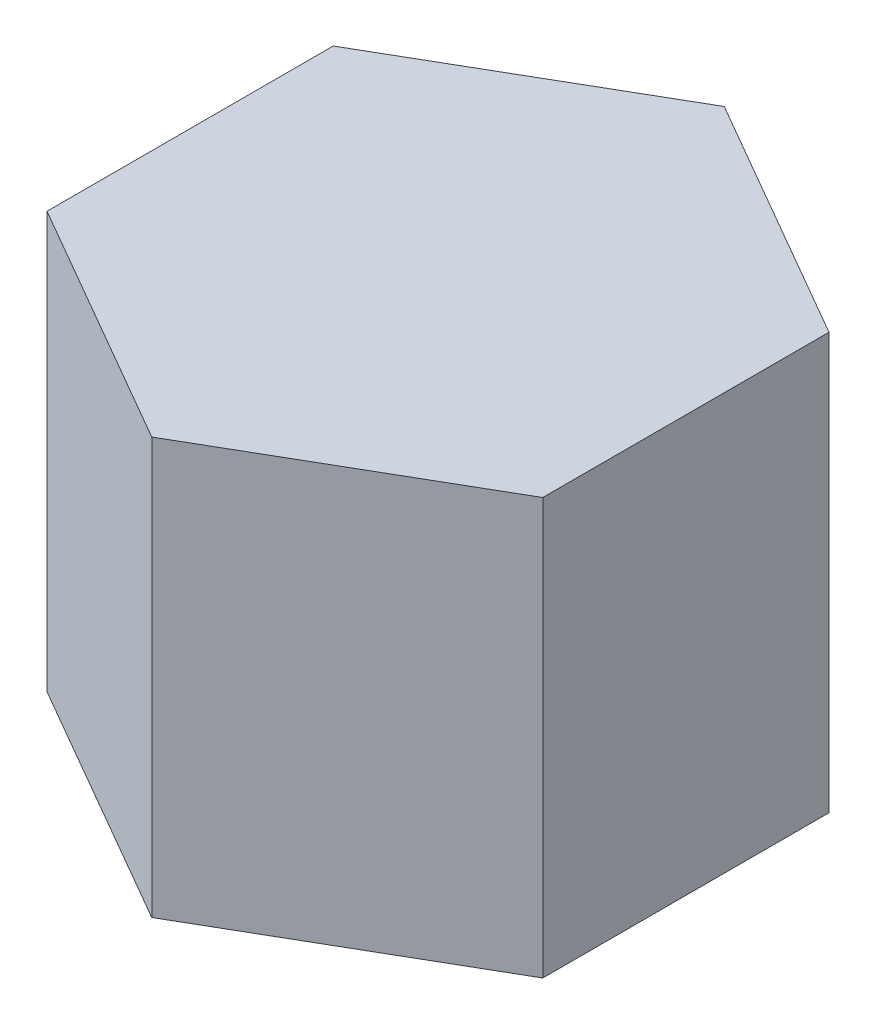
ISO-10303-21;
HEADER;
FILE_DESCRIPTION(('STEP AP214'),'2;1');
FILE_NAME('part.step','',(''),(''),'','','');
FILE_SCHEMA(('AUTOMOTIVE_DESIGN { 1 0 10303 214 1 1 1 1 }'));
ENDSEC;
DATA;
#1=APPLICATION_CONTEXT('core data for automotive mechanical design processes');
#2=APPLICATION_PROTOCOL_DEFINITION('international standard','automotive_design',2000,#1);
#3=PRODUCT_CONTEXT('',#1,'mechanical');
#4=PRODUCT('Part','Part','',(#3));
#5=PRODUCT_RELATED_PRODUCT_CATEGORY('part','',(#4));
#6=PRODUCT_DEFINITION_FORMATION('','',#4);
#7=PRODUCT_DEFINITION_CONTEXT('part definition',#1,'design');
#8=PRODUCT_DEFINITION('design','',#6,#7);
#9=PRODUCT_DEFINITION_SHAPE('','',#8);
#10=(LENGTH_UNIT() NAMED_UNIT(*) SI_UNIT(.MILLI.,.METRE.));
#11=(NAMED_UNIT(*) PLANE_ANGLE_UNIT() SI_UNIT($,.RADIAN.));
#12=(NAMED_UNIT(*) SI_UNIT($,.STERADIAN.) SOLID_ANGLE_UNIT());
#13=UNCERTAINTY_MEASURE_WITH_UNIT(LENGTH_MEASURE(1.E-05),#10,'distance_accuracy_value','');
#14=(GEOMETRIC_REPRESENTATION_CONTEXT(3) GLOBAL_UNCERTAINTY_ASSIGNED_CONTEXT((#13)) GLOBAL_UNIT_ASSIGNED_CONTEXT((#10,
#11,#12)) REPRESENTATION_CONTEXT('',''));
#15=CARTESIAN_POINT('',(0.,0.,0.));
#16=DIRECTION('',(0.,0.,1.));
#17=DIRECTION('',(1.,0.,0.));
#18=AXIS2_PLACEMENT_3D('',#15,#16,#17);
#19=CARTESIAN_POINT('',(207.839551417382,-147.556598747966,290.81594581671));
#20=DIRECTION('',(-0.500000000000028,0.,-0.866025403784422));
#21=DIRECTION('',(-0.866025403784423,0.,0.500000000000028));
#22=AXIS2_PLACEMENT_3D('',#19,#20,#21);
#23=PLANE('',#22);
#24=CARTESIAN_POINT('',(208.142660308706,-147.047793579175,290.64094581671));
#25=DIRECTION('',(-0.866025403784422,0.,0.500000000000028));
#26=VECTOR('',#25,1.);
#27=LINE('',#24,#26);
#28=CARTESIAN_POINT('',(208.142660308706,-147.047793579175,290.64094581671));
#29=VERTEX_POINT('',#28);
#30=CARTESIAN_POINT('',(207.839551417382,-147.047793579175,290.81594581671));
#31=VERTEX_POINT('',#30);
#32=EDGE_CURVE('E170',#29,#31,#27,.T.);
#33=ORIENTED_EDGE('',*,*,#32,.T.);
#34=CARTESIAN_POINT('',(207.839551417382,-147.556598747966,290.81594581671));
#35=DIRECTION('',(0.,1.,0.));
#36=VECTOR('',#35,1.);
#37=LINE('',#34,#36);
#38=CARTESIAN_POINT('',(207.839551417382,-147.556598747966,290.81594581671));
#39=VERTEX_POINT('',#38);
#40=EDGE_CURVE('E35',#39,#31,#37,.T.);
#41=ORIENTED_EDGE('',*,*,#40,.F.);
#42=CARTESIAN_POINT('',(208.142660308706,-147.556598747966,290.64094581671));
#43=DIRECTION('',(-0.866025403784422,0.,0.500000000000028));
#44=VECTOR('',#43,1.);
#45=LINE('',#42,#44);
#46=CARTESIAN_POINT('',(208.142660308706,-147.556598747966,290.64094581671));
#47=VERTEX_POINT('',#46);
#48=EDGE_CURVE('E159',#47,#39,#45,.T.);
#49=ORIENTED_EDGE('',*,*,#48,.F.);
#50=CARTESIAN_POINT('',(208.142660308706,-147.556598747966,290.64094581671));
#51=DIRECTION('',(0.,1.,0.));
#52=VECTOR('',#51,1.);
#53=LINE('',#50,#52);
#54=EDGE_CURVE('E10',#47,#29,#53,.T.);
#55=ORIENTED_EDGE('',*,*,#54,.T.);
#56=EDGE_LOOP('',(#33,#41,#49,#55));
#57=FACE_BOUND('',#56,.T.);
#58=ADVANCED_FACE('F16',(#57),#23,.F.);
#59=CARTESIAN_POINT('',(208.142660308706,-147.556598747966,291.594471220494));
#60=DIRECTION('',(-1.,0.,0.));
#61=DIRECTION('',(0.,-1.,0.));
#62=AXIS2_PLACEMENT_3D('',#59,#60,#61);
#63=PLANE('',#62);
#64=CARTESIAN_POINT('',(208.142660308706,-147.047793579175,290.29094581671));
#65=DIRECTION('',(0.,0.,1.));
#66=VECTOR('',#65,1.);
#67=LINE('',#64,#66);
#68=CARTESIAN_POINT('',(208.142660308706,-147.047793579175,290.29094581671));
#69=VERTEX_POINT('',#68);
#70=EDGE_CURVE('E167',#69,#29,#67,.T.);
#71=ORIENTED_EDGE('',*,*,#70,.T.);
#72=ORIENTED_EDGE('',*,*,#54,.F.);
#73=CARTESIAN_POINT('',(208.142660308706,-147.556598747966,290.29094581671));
#74=DIRECTION('',(0.,0.,1.));
#75=VECTOR('',#74,1.);
#76=LINE('',#73,#75);
#77=CARTESIAN_POINT('',(208.142660308706,-147.556598747966,290.29094581671));
#78=VERTEX_POINT('',#77);
#79=EDGE_CURVE('E156',#78,#47,#76,.T.);
#80=ORIENTED_EDGE('',*,*,#79,.F.);
#81=CARTESIAN_POINT('',(208.142660308706,-147.556598747966,290.29094581671));
#82=DIRECTION('',(0.,1.,0.));
#83=VECTOR('',#82,1.);
#84=LINE('',#81,#83);
#85=EDGE_CURVE('E27',#78,#69,#84,.T.);
#86=ORIENTED_EDGE('',*,*,#85,.T.);
#87=EDGE_LOOP('',(#71,#72,#80,#86));
#88=FACE_BOUND('',#87,.T.);
#89=ADVANCED_FACE('F189',(#88),#63,.F.);
#90=CARTESIAN_POINT('',(208.142660308706,-147.556598747966,290.29094581671));
#91=DIRECTION('',(-0.500000000000028,0.,0.866025403784422));
#92=DIRECTION('',(0.866025403784423,0.,0.500000000000028));
#93=AXIS2_PLACEMENT_3D('',#90,#91,#92);
#94=PLANE('',#93);
#95=CARTESIAN_POINT('',(207.839551417381,-147.047793579175,290.11594581671));
#96=DIRECTION('',(0.866025403784422,0.,0.500000000000028));
#97=VECTOR('',#96,1.);
#98=LINE('',#95,#97);
#99=CARTESIAN_POINT('',(207.839551417382,-147.047793579175,290.11594581671));
#100=VERTEX_POINT('',#99);
#101=EDGE_CURVE('E163',#100,#69,#98,.T.);
#102=ORIENTED_EDGE('',*,*,#101,.T.);
#103=ORIENTED_EDGE('',*,*,#85,.F.);
#104=CARTESIAN_POINT('',(207.839551417381,-147.556598747966,290.11594581671));
#105=DIRECTION('',(0.866025403784422,0.,0.500000000000028));
#106=VECTOR('',#105,1.);
#107=LINE('',#104,#106);
#108=CARTESIAN_POINT('',(207.839551417382,-147.556598747966,290.11594581671));
#109=VERTEX_POINT('',#108);
#110=EDGE_CURVE('E106',#109,#78,#107,.T.);
#111=ORIENTED_EDGE('',*,*,#110,.F.);
#112=CARTESIAN_POINT('',(207.839551417382,-147.556598747966,290.11594581671));
#113=DIRECTION('',(0.,1.,0.));
#114=VECTOR('',#113,1.);
#115=LINE('',#112,#114);
#116=EDGE_CURVE('E94',#109,#100,#115,.T.);
#117=ORIENTED_EDGE('',*,*,#116,.T.);
#118=EDGE_LOOP('',(#102,#103,#111,#117));
#119=FACE_BOUND('',#118,.T.);
#120=ADVANCED_FACE('F198',(#119),#94,.F.);
#121=CARTESIAN_POINT('',(207.839551417382,-147.556598747966,290.11594581671));
#122=DIRECTION('',(0.499999999999943,0.,0.866025403784471));
#123=DIRECTION('',(0.866025403784471,0.,-0.499999999999943));
#124=AXIS2_PLACEMENT_3D('',#121,#122,#123);
#125=PLANE('',#124);
#126=CARTESIAN_POINT('',(207.536442526057,-147.047793579175,290.29094581671));
#127=DIRECTION('',(0.866025403784471,0.,-0.499999999999943));
#128=VECTOR('',#127,1.);
#129=LINE('',#126,#128);
#130=CARTESIAN_POINT('',(207.536442526057,-147.047793579175,290.29094581671));
#131=VERTEX_POINT('',#130);
#132=EDGE_CURVE('E162',#131,#100,#129,.T.);
#133=ORIENTED_EDGE('',*,*,#132,.T.);
#134=ORIENTED_EDGE('',*,*,#116,.F.);
#135=CARTESIAN_POINT('',(207.536442526057,-147.556598747966,290.29094581671));
#136=DIRECTION('',(0.866025403784471,0.,-0.499999999999943));
#137=VECTOR('',#136,1.);
#138=LINE('',#135,#137);
#139=CARTESIAN_POINT('',(207.536442526057,-147.556598747966,290.29094581671));
#140=VERTEX_POINT('',#139);
#141=EDGE_CURVE('E98',#140,#109,#138,.T.);
#142=ORIENTED_EDGE('',*,*,#141,.F.);
#143=CARTESIAN_POINT('',(207.536442526057,-147.556598747966,290.29094581671));
#144=DIRECTION('',(0.,1.,0.));
#145=VECTOR('',#144,1.);
#146=LINE('',#143,#145);
#147=EDGE_CURVE('E79',#140,#131,#146,.T.);
#148=ORIENTED_EDGE('',*,*,#147,.T.);
#149=EDGE_LOOP('',(#133,#134,#142,#148));
#150=FACE_BOUND('',#149,.T.);
#151=ADVANCED_FACE('F100',(#150),#125,.F.);
#152=CARTESIAN_POINT('',(207.536442526057,-147.556598747966,291.594471220494));
#153=DIRECTION('',(1.,0.,0.));
#154=DIRECTION('',(0.,1.,0.));
#155=AXIS2_PLACEMENT_3D('',#152,#153,#154);
#156=PLANE('',#155);
#157=CARTESIAN_POINT('',(207.536442526057,-147.047793579175,290.64094581671));
#158=DIRECTION('',(0.,0.,-1.));
#159=VECTOR('',#158,1.);
#160=LINE('',#157,#159);
#161=CARTESIAN_POINT('',(207.536442526057,-147.047793579175,290.64094581671));
#162=VERTEX_POINT('',#161);
#163=EDGE_CURVE('E88',#162,#131,#160,.T.);
#164=ORIENTED_EDGE('',*,*,#163,.T.);
#165=ORIENTED_EDGE('',*,*,#147,.F.);
#166=CARTESIAN_POINT('',(207.536442526057,-147.556598747966,290.64094581671));
#167=DIRECTION('',(0.,0.,-1.));
#168=VECTOR('',#167,1.);
#169=LINE('',#166,#168);
#170=CARTESIAN_POINT('',(207.536442526057,-147.556598747966,290.64094581671));
#171=VERTEX_POINT('',#170);
#172=EDGE_CURVE('E84',#171,#140,#169,.T.);
#173=ORIENTED_EDGE('',*,*,#172,.F.);
#174=CARTESIAN_POINT('',(207.536442526057,-147.556598747966,290.64094581671));
#175=DIRECTION('',(0.,1.,0.));
#176=VECTOR('',#175,1.);
#177=LINE('',#174,#176);
#178=EDGE_CURVE('E58',#171,#162,#177,.T.);
#179=ORIENTED_EDGE('',*,*,#178,.T.);
#180=EDGE_LOOP('',(#164,#165,#173,#179));
#181=FACE_BOUND('',#180,.T.);
#182=ADVANCED_FACE('F82',(#181),#156,.F.);
#183=CARTESIAN_POINT('',(207.536442526057,-147.556598747966,290.64094581671));
#184=DIRECTION('',(0.499999999999978,0.,-0.866025403784452));
#185=DIRECTION('',(-0.866025403784452,0.,-0.499999999999978));
#186=AXIS2_PLACEMENT_3D('',#183,#184,#185);
#187=PLANE('',#186);
#188=CARTESIAN_POINT('',(207.839551417382,-147.047793579175,290.81594581671));
#189=DIRECTION('',(-0.866025403784452,0.,-0.499999999999978));
#190=VECTOR('',#189,1.);
#191=LINE('',#188,#190);
#192=EDGE_CURVE('E160',#31,#162,#191,.T.);
#193=ORIENTED_EDGE('',*,*,#192,.T.);
#194=ORIENTED_EDGE('',*,*,#178,.F.);
#195=CARTESIAN_POINT('',(207.839551417382,-147.556598747966,290.81594581671));
#196=DIRECTION('',(-0.866025403784452,0.,-0.499999999999978));
#197=VECTOR('',#196,1.);
#198=LINE('',#195,#197);
#199=EDGE_CURVE('E112',#39,#171,#198,.T.);
#200=ORIENTED_EDGE('',*,*,#199,.F.);
#201=ORIENTED_EDGE('',*,*,#40,.T.);
#202=EDGE_LOOP('',(#193,#194,#200,#201));
#203=FACE_BOUND('',#202,.T.);
#204=ADVANCED_FACE('F131',(#203),#187,.F.);
#205=CARTESIAN_POINT('',(206.491105863044,-147.556598747966,291.594471220494));
#206=DIRECTION('',(0.,1.,0.));
#207=DIRECTION('',(-1.,0.,0.));
#208=AXIS2_PLACEMENT_3D('',#205,#206,#207);
#209=PLANE('',#208);
#210=ORIENTED_EDGE('',*,*,#48,.T.);
#211=ORIENTED_EDGE('',*,*,#199,.T.);
#212=ORIENTED_EDGE('',*,*,#172,.T.);
#213=ORIENTED_EDGE('',*,*,#141,.T.);
#214=ORIENTED_EDGE('',*,*,#110,.T.);
#215=ORIENTED_EDGE('',*,*,#79,.T.);
#216=EDGE_LOOP('',(#210,#211,#212,#213,#214,#215));
#217=FACE_BOUND('',#216,.T.);
#218=ADVANCED_FACE('F111',(#217),#209,.F.);
#219=CARTESIAN_POINT('',(206.491105863044,-147.047793579175,291.594471220494));
#220=DIRECTION('',(0.,1.,0.));
#221=DIRECTION('',(-1.,0.,0.));
#222=AXIS2_PLACEMENT_3D('',#219,#220,#221);
#223=PLANE('',#222);
#224=ORIENTED_EDGE('',*,*,#32,.F.);
#225=ORIENTED_EDGE('',*,*,#70,.F.);
#226=ORIENTED_EDGE('',*,*,#101,.F.);
#227=ORIENTED_EDGE('',*,*,#132,.F.);
#228=ORIENTED_EDGE('',*,*,#163,.F.);
#229=ORIENTED_EDGE('',*,*,#192,.F.);
#230=EDGE_LOOP('',(#224,#225,#226,#227,#228,#229));
#231=FACE_BOUND('',#230,.T.);
#232=ADVANCED_FACE('F130',(#231),#223,.T.);
#233=CLOSED_SHELL('',(#58,#89,#120,#151,#182,#204,#218,#232));
#234=MANIFOLD_SOLID_BREP('B1',#233);
#235=ADVANCED_BREP_SHAPE_REPRESENTATION('',(#18,#234),#14);
#236=SHAPE_DEFINITION_REPRESENTATION(#9,#235);
ENDSEC;
END-ISO-10303-21;
